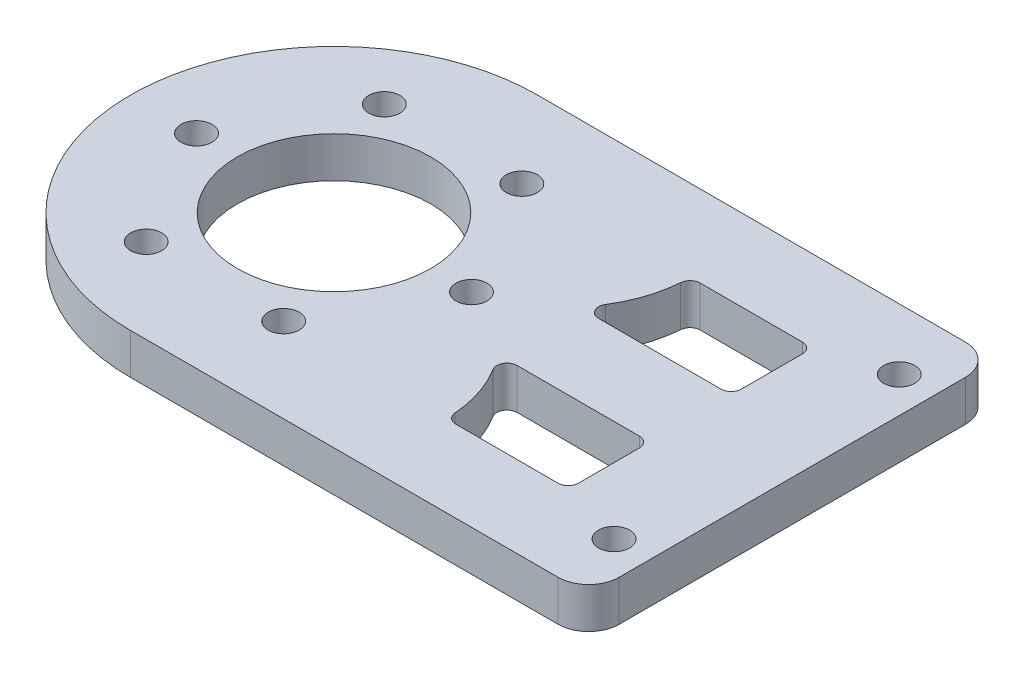
ISO-10303-21;
HEADER;
FILE_DESCRIPTION(('STEP AP214'),'2;1');
FILE_NAME('part.step','',(''),(''),'','','');
FILE_SCHEMA(('AUTOMOTIVE_DESIGN { 1 0 10303 214 1 1 1 1 }'));
ENDSEC;
DATA;
#1=APPLICATION_CONTEXT('core data for automotive mechanical design processes');
#2=APPLICATION_PROTOCOL_DEFINITION('international standard','automotive_design',2000,#1);
#3=PRODUCT_CONTEXT('',#1,'mechanical');
#4=PRODUCT('Part','Part','',(#3));
#5=PRODUCT_RELATED_PRODUCT_CATEGORY('part','',(#4));
#6=PRODUCT_DEFINITION_FORMATION('','',#4);
#7=PRODUCT_DEFINITION_CONTEXT('part definition',#1,'design');
#8=PRODUCT_DEFINITION('design','',#6,#7);
#9=PRODUCT_DEFINITION_SHAPE('','',#8);
#10=(LENGTH_UNIT() NAMED_UNIT(*) SI_UNIT(.MILLI.,.METRE.));
#11=(NAMED_UNIT(*) PLANE_ANGLE_UNIT() SI_UNIT($,.RADIAN.));
#12=(NAMED_UNIT(*) SI_UNIT($,.STERADIAN.) SOLID_ANGLE_UNIT());
#13=UNCERTAINTY_MEASURE_WITH_UNIT(LENGTH_MEASURE(1.E-05),#10,'distance_accuracy_value','');
#14=(GEOMETRIC_REPRESENTATION_CONTEXT(3) GLOBAL_UNCERTAINTY_ASSIGNED_CONTEXT((#13)) GLOBAL_UNIT_ASSIGNED_CONTEXT((#10,
#11,#12)) REPRESENTATION_CONTEXT('',''));
#15=CARTESIAN_POINT('',(0.,0.,0.));
#16=DIRECTION('',(0.,0.,1.));
#17=DIRECTION('',(1.,0.,0.));
#18=AXIS2_PLACEMENT_3D('',#15,#16,#17);
#19=CARTESIAN_POINT('',(-22.5,4.,0.));
#20=DIRECTION('',(0.,-1.,0.));
#21=DIRECTION('',(0.,0.,-1.));
#22=AXIS2_PLACEMENT_3D('',#19,#20,#21);
#23=CYLINDRICAL_SURFACE('',#22,20.);
#24=CARTESIAN_POINT('',(-22.5,0.,0.));
#25=DIRECTION('',(0.,1.,0.));
#26=DIRECTION('',(0.,0.,1.));
#27=AXIS2_PLACEMENT_3D('',#24,#25,#26);
#28=CIRCLE('',#27,20.);
#29=CARTESIAN_POINT('',(-22.5,0.,-20.));
#30=VERTEX_POINT('',#29);
#31=CARTESIAN_POINT('',(-22.5,0.,20.));
#32=VERTEX_POINT('',#31);
#33=EDGE_CURVE('E214',#30,#32,#28,.T.);
#34=ORIENTED_EDGE('',*,*,#33,.T.);
#35=DIRECTION('',(0.,-1.,0.));
#36=VECTOR('',#35,1.);
#37=CARTESIAN_POINT('',(-22.5,4.,20.));
#38=LINE('',#37,#36);
#39=CARTESIAN_POINT('',(-22.5,4.,20.));
#40=VERTEX_POINT('',#39);
#41=EDGE_CURVE('E195',#40,#32,#38,.T.);
#42=ORIENTED_EDGE('',*,*,#41,.F.);
#43=CARTESIAN_POINT('',(-22.5,4.,0.));
#44=DIRECTION('',(0.,1.,0.));
#45=DIRECTION('',(0.,0.,1.));
#46=AXIS2_PLACEMENT_3D('',#43,#44,#45);
#47=CIRCLE('',#46,20.);
#48=CARTESIAN_POINT('',(-22.5,4.,-20.));
#49=VERTEX_POINT('',#48);
#50=EDGE_CURVE('E202',#49,#40,#47,.T.);
#51=ORIENTED_EDGE('',*,*,#50,.F.);
#52=DIRECTION('',(0.,-1.,0.));
#53=VECTOR('',#52,1.);
#54=CARTESIAN_POINT('',(-22.5,4.,-20.));
#55=LINE('',#54,#53);
#56=EDGE_CURVE('E216',#49,#30,#55,.T.);
#57=ORIENTED_EDGE('',*,*,#56,.T.);
#58=EDGE_LOOP('',(#34,#42,#51,#57));
#59=FACE_BOUND('',#58,.T.);
#60=ADVANCED_FACE('F41',(#59),#23,.T.);
#61=CARTESIAN_POINT('',(0.,4.,20.));
#62=DIRECTION('',(0.,0.,-1.));
#63=DIRECTION('',(-1.,0.,0.));
#64=AXIS2_PLACEMENT_3D('',#61,#62,#63);
#65=PLANE('',#64);
#66=DIRECTION('',(1.,0.,0.));
#67=VECTOR('',#66,1.);
#68=CARTESIAN_POINT('',(0.,0.,20.));
#69=LINE('',#68,#67);
#70=CARTESIAN_POINT('',(19.5,0.,20.));
#71=VERTEX_POINT('',#70);
#72=EDGE_CURVE('E397',#32,#71,#69,.T.);
#73=ORIENTED_EDGE('',*,*,#72,.T.);
#74=DIRECTION('',(0.,-1.,0.));
#75=VECTOR('',#74,1.);
#76=CARTESIAN_POINT('',(19.5,4.,20.));
#77=LINE('',#76,#75);
#78=CARTESIAN_POINT('',(19.5,4.,20.));
#79=VERTEX_POINT('',#78);
#80=EDGE_CURVE('E198',#71,#79,#77,.F.);
#81=ORIENTED_EDGE('',*,*,#80,.T.);
#82=DIRECTION('',(1.,0.,0.));
#83=VECTOR('',#82,1.);
#84=CARTESIAN_POINT('',(0.,4.,20.));
#85=LINE('',#84,#83);
#86=EDGE_CURVE('E190',#40,#79,#85,.T.);
#87=ORIENTED_EDGE('',*,*,#86,.F.);
#88=ORIENTED_EDGE('',*,*,#41,.T.);
#89=EDGE_LOOP('',(#73,#81,#87,#88));
#90=FACE_BOUND('',#89,.T.);
#91=ADVANCED_FACE('F193',(#90),#65,.F.);
#92=CARTESIAN_POINT('',(22.5,4.,0.));
#93=DIRECTION('',(-1.,0.,0.));
#94=DIRECTION('',(0.,0.,1.));
#95=AXIS2_PLACEMENT_3D('',#92,#93,#94);
#96=PLANE('',#95);
#97=DIRECTION('',(0.,0.,-1.));
#98=VECTOR('',#97,1.);
#99=CARTESIAN_POINT('',(22.5,0.,0.));
#100=LINE('',#99,#98);
#101=CARTESIAN_POINT('',(22.5,0.,17.));
#102=VERTEX_POINT('',#101);
#103=CARTESIAN_POINT('',(22.5,0.,-17.));
#104=VERTEX_POINT('',#103);
#105=EDGE_CURVE('E399',#102,#104,#100,.T.);
#106=ORIENTED_EDGE('',*,*,#105,.T.);
#107=DIRECTION('',(0.,-1.,0.));
#108=VECTOR('',#107,1.);
#109=CARTESIAN_POINT('',(22.5,4.,-17.));
#110=LINE('',#109,#108);
#111=CARTESIAN_POINT('',(22.5,4.,-17.));
#112=VERTEX_POINT('',#111);
#113=EDGE_CURVE('E230',#104,#112,#110,.F.);
#114=ORIENTED_EDGE('',*,*,#113,.T.);
#115=DIRECTION('',(0.,0.,-1.));
#116=VECTOR('',#115,1.);
#117=CARTESIAN_POINT('',(22.5,4.,0.));
#118=LINE('',#117,#116);
#119=CARTESIAN_POINT('',(22.5,4.,17.));
#120=VERTEX_POINT('',#119);
#121=EDGE_CURVE('E201',#120,#112,#118,.T.);
#122=ORIENTED_EDGE('',*,*,#121,.F.);
#123=DIRECTION('',(0.,-1.,0.));
#124=VECTOR('',#123,1.);
#125=CARTESIAN_POINT('',(22.5,4.,17.));
#126=LINE('',#125,#124);
#127=EDGE_CURVE('E227',#120,#102,#126,.T.);
#128=ORIENTED_EDGE('',*,*,#127,.T.);
#129=EDGE_LOOP('',(#106,#114,#122,#128));
#130=FACE_BOUND('',#129,.T.);
#131=ADVANCED_FACE('F414',(#130),#96,.F.);
#132=CARTESIAN_POINT('',(0.,4.,-20.));
#133=DIRECTION('',(0.,0.,-1.));
#134=DIRECTION('',(-1.,0.,0.));
#135=AXIS2_PLACEMENT_3D('',#132,#133,#134);
#136=PLANE('',#135);
#137=DIRECTION('',(1.,0.,0.));
#138=VECTOR('',#137,1.);
#139=CARTESIAN_POINT('',(0.,4.,-20.));
#140=LINE('',#139,#138);
#141=CARTESIAN_POINT('',(19.5,4.,-20.));
#142=VERTEX_POINT('',#141);
#143=EDGE_CURVE('E209',#49,#142,#140,.T.);
#144=ORIENTED_EDGE('',*,*,#143,.T.);
#145=DIRECTION('',(0.,-1.,0.));
#146=VECTOR('',#145,1.);
#147=CARTESIAN_POINT('',(19.5,0.,-20.));
#148=LINE('',#147,#146);
#149=CARTESIAN_POINT('',(19.5,0.,-20.));
#150=VERTEX_POINT('',#149);
#151=EDGE_CURVE('E215',#142,#150,#148,.T.);
#152=ORIENTED_EDGE('',*,*,#151,.T.);
#153=DIRECTION('',(1.,0.,0.));
#154=VECTOR('',#153,1.);
#155=CARTESIAN_POINT('',(0.,0.,-20.));
#156=LINE('',#155,#154);
#157=EDGE_CURVE('E211',#30,#150,#156,.T.);
#158=ORIENTED_EDGE('',*,*,#157,.F.);
#159=ORIENTED_EDGE('',*,*,#56,.F.);
#160=EDGE_LOOP('',(#144,#152,#158,#159));
#161=FACE_BOUND('',#160,.T.);
#162=ADVANCED_FACE('F406',(#161),#136,.T.);
#163=CARTESIAN_POINT('',(0.,4.,0.));
#164=DIRECTION('',(0.,1.,0.));
#165=DIRECTION('',(0.,0.,1.));
#166=AXIS2_PLACEMENT_3D('',#163,#164,#165);
#167=PLANE('',#166);
#168=CARTESIAN_POINT('',(-11.6666666666667,4.,12.));
#169=DIRECTION('',(0.,1.,0.));
#170=DIRECTION('',(0.,0.,1.));
#171=AXIS2_PLACEMENT_3D('',#168,#169,#170);
#172=CIRCLE('',#171,12.1666666666667);
#173=CARTESIAN_POINT('',(-1.36190229571842,4.,5.53164556962025));
#174=VERTEX_POINT('',#173);
#175=CARTESIAN_POINT('',(0.464858719928123,4.,11.0759493670886));
#176=VERTEX_POINT('',#175);
#177=EDGE_CURVE('E330',#174,#176,#172,.F.);
#178=ORIENTED_EDGE('',*,*,#177,.F.);
#179=CARTESIAN_POINT('',(-0.514935361119928,4.,5.));
#180=DIRECTION('',(0.,1.,0.));
#181=DIRECTION('',(0.,0.,1.));
#182=AXIS2_PLACEMENT_3D('',#179,#180,#181);
#183=CIRCLE('',#182,1.);
#184=CARTESIAN_POINT('',(-0.514935361119928,4.,4.));
#185=VERTEX_POINT('',#184);
#186=EDGE_CURVE('E11',#174,#185,#183,.F.);
#187=ORIENTED_EDGE('',*,*,#186,.T.);
#188=DIRECTION('',(-1.,0.,0.));
#189=VECTOR('',#188,1.);
#190=CARTESIAN_POINT('',(0.,4.,4.));
#191=LINE('',#190,#189);
#192=CARTESIAN_POINT('',(11.5,4.,4.));
#193=VERTEX_POINT('',#192);
#194=EDGE_CURVE('E328',#193,#185,#191,.T.);
#195=ORIENTED_EDGE('',*,*,#194,.F.);
#196=CARTESIAN_POINT('',(11.5,4.,5.));
#197=DIRECTION('',(0.,1.,0.));
#198=DIRECTION('',(0.,0.,1.));
#199=AXIS2_PLACEMENT_3D('',#196,#197,#198);
#200=CIRCLE('',#199,1.);
#201=CARTESIAN_POINT('',(12.5,4.,5.));
#202=VERTEX_POINT('',#201);
#203=EDGE_CURVE('E309',#193,#202,#200,.F.);
#204=ORIENTED_EDGE('',*,*,#203,.T.);
#205=DIRECTION('',(0.,0.,-1.));
#206=VECTOR('',#205,1.);
#207=CARTESIAN_POINT('',(12.5,4.,0.));
#208=LINE('',#207,#206);
#209=CARTESIAN_POINT('',(12.5,4.,11.));
#210=VERTEX_POINT('',#209);
#211=EDGE_CURVE('E334',#210,#202,#208,.T.);
#212=ORIENTED_EDGE('',*,*,#211,.F.);
#213=CARTESIAN_POINT('',(11.5,4.,11.));
#214=DIRECTION('',(0.,1.,0.));
#215=DIRECTION('',(0.,0.,1.));
#216=AXIS2_PLACEMENT_3D('',#213,#214,#215);
#217=CIRCLE('',#216,1.);
#218=CARTESIAN_POINT('',(11.5,4.,12.));
#219=VERTEX_POINT('',#218);
#220=EDGE_CURVE('E306',#210,#219,#217,.F.);
#221=ORIENTED_EDGE('',*,*,#220,.T.);
#222=DIRECTION('',(1.,0.,0.));
#223=VECTOR('',#222,1.);
#224=CARTESIAN_POINT('',(0.,4.,12.));
#225=LINE('',#224,#223);
#226=CARTESIAN_POINT('',(1.46197039553865,4.,12.));
#227=VERTEX_POINT('',#226);
#228=EDGE_CURVE('E338',#227,#219,#225,.T.);
#229=ORIENTED_EDGE('',*,*,#228,.F.);
#230=CARTESIAN_POINT('',(1.46197039553865,4.,11.));
#231=DIRECTION('',(0.,1.,0.));
#232=DIRECTION('',(0.,0.,1.));
#233=AXIS2_PLACEMENT_3D('',#230,#231,#232);
#234=CIRCLE('',#233,1.);
#235=EDGE_CURVE('E302',#227,#176,#234,.F.);
#236=ORIENTED_EDGE('',*,*,#235,.T.);
#237=EDGE_LOOP('',(#178,#187,#195,#204,#212,#221,#229,#236));
#238=FACE_BOUND('',#237,.T.);
#239=CARTESIAN_POINT('',(-11.6666666666667,4.,-12.));
#240=DIRECTION('',(0.,1.,0.));
#241=DIRECTION('',(0.,0.,1.));
#242=AXIS2_PLACEMENT_3D('',#239,#240,#241);
#243=CIRCLE('',#242,12.1666666666667);
#244=CARTESIAN_POINT('',(0.464858719928123,4.,-11.0759493670886));
#245=VERTEX_POINT('',#244);
#246=CARTESIAN_POINT('',(-1.36190229571842,4.,-5.53164556962025));
#247=VERTEX_POINT('',#246);
#248=EDGE_CURVE('E335',#245,#247,#243,.F.);
#249=ORIENTED_EDGE('',*,*,#248,.F.);
#250=CARTESIAN_POINT('',(1.46197039553865,4.,-11.));
#251=DIRECTION('',(0.,1.,0.));
#252=DIRECTION('',(0.,0.,1.));
#253=AXIS2_PLACEMENT_3D('',#250,#251,#252);
#254=CIRCLE('',#253,1.);
#255=CARTESIAN_POINT('',(1.46197039553865,4.,-12.));
#256=VERTEX_POINT('',#255);
#257=EDGE_CURVE('E298',#245,#256,#254,.F.);
#258=ORIENTED_EDGE('',*,*,#257,.T.);
#259=DIRECTION('',(-1.,0.,0.));
#260=VECTOR('',#259,1.);
#261=CARTESIAN_POINT('',(0.,4.,-12.));
#262=LINE('',#261,#260);
#263=CARTESIAN_POINT('',(11.5,4.,-12.));
#264=VERTEX_POINT('',#263);
#265=EDGE_CURVE('E512',#264,#256,#262,.T.);
#266=ORIENTED_EDGE('',*,*,#265,.F.);
#267=CARTESIAN_POINT('',(11.5,4.,-11.));
#268=DIRECTION('',(0.,1.,0.));
#269=DIRECTION('',(0.,0.,1.));
#270=AXIS2_PLACEMENT_3D('',#267,#268,#269);
#271=CIRCLE('',#270,1.);
#272=CARTESIAN_POINT('',(12.5,4.,-11.));
#273=VERTEX_POINT('',#272);
#274=EDGE_CURVE('E294',#264,#273,#271,.F.);
#275=ORIENTED_EDGE('',*,*,#274,.T.);
#276=DIRECTION('',(0.,0.,-1.));
#277=VECTOR('',#276,1.);
#278=CARTESIAN_POINT('',(12.5,4.,0.));
#279=LINE('',#278,#277);
#280=CARTESIAN_POINT('',(12.5,4.,-5.00000000000001));
#281=VERTEX_POINT('',#280);
#282=EDGE_CURVE('E541',#281,#273,#279,.T.);
#283=ORIENTED_EDGE('',*,*,#282,.F.);
#284=CARTESIAN_POINT('',(11.5,4.,-5.00000000000001));
#285=DIRECTION('',(0.,1.,0.));
#286=DIRECTION('',(0.,0.,1.));
#287=AXIS2_PLACEMENT_3D('',#284,#285,#286);
#288=CIRCLE('',#287,1.);
#289=CARTESIAN_POINT('',(11.5,4.,-4.00000000000001));
#290=VERTEX_POINT('',#289);
#291=EDGE_CURVE('E290',#281,#290,#288,.F.);
#292=ORIENTED_EDGE('',*,*,#291,.T.);
#293=DIRECTION('',(1.,0.,0.));
#294=VECTOR('',#293,1.);
#295=CARTESIAN_POINT('',(0.,4.,-4.));
#296=LINE('',#295,#294);
#297=CARTESIAN_POINT('',(-0.514935361119928,4.,-4.));
#298=VERTEX_POINT('',#297);
#299=EDGE_CURVE('E341',#298,#290,#296,.T.);
#300=ORIENTED_EDGE('',*,*,#299,.F.);
#301=CARTESIAN_POINT('',(-0.514935361119928,4.,-5.));
#302=DIRECTION('',(0.,1.,0.));
#303=DIRECTION('',(0.,0.,1.));
#304=AXIS2_PLACEMENT_3D('',#301,#302,#303);
#305=CIRCLE('',#304,1.);
#306=EDGE_CURVE('E286',#298,#247,#305,.F.);
#307=ORIENTED_EDGE('',*,*,#306,.T.);
#308=EDGE_LOOP('',(#249,#258,#266,#275,#283,#292,#300,#307));
#309=FACE_BOUND('',#308,.T.);
#310=CARTESIAN_POINT('',(19.0000000000001,4.,13.9999999999024));
#311=DIRECTION('',(0.,1.,0.));
#312=DIRECTION('',(0.,0.,1.));
#313=AXIS2_PLACEMENT_3D('',#310,#311,#312);
#314=CIRCLE('',#313,1.525);
#315=CARTESIAN_POINT('',(19.0000000000001,4.,15.5249999999024));
#316=VERTEX_POINT('',#315);
#317=EDGE_CURVE('E242',#316,#316,#314,.T.);
#318=ORIENTED_EDGE('',*,*,#317,.F.);
#319=EDGE_LOOP('',(#318));
#320=FACE_BOUND('',#319,.T.);
#321=CARTESIAN_POINT('',(18.9999999984967,4.,-13.9999999984623));
#322=DIRECTION('',(0.,1.,0.));
#323=DIRECTION('',(0.,0.,1.));
#324=AXIS2_PLACEMENT_3D('',#321,#322,#323);
#325=CIRCLE('',#324,1.525);
#326=CARTESIAN_POINT('',(18.9999999984967,4.,-12.4749999984623));
#327=VERTEX_POINT('',#326);
#328=EDGE_CURVE('E348',#327,#327,#325,.T.);
#329=ORIENTED_EDGE('',*,*,#328,.F.);
#330=EDGE_LOOP('',(#329));
#331=FACE_BOUND('',#330,.T.);
#332=CARTESIAN_POINT('',(-22.5,4.,0.));
#333=DIRECTION('',(0.,-1.,0.));
#334=DIRECTION('',(0.,0.,-1.));
#335=AXIS2_PLACEMENT_3D('',#332,#333,#334);
#336=CIRCLE('',#335,9.5);
#337=CARTESIAN_POINT('',(-22.5,4.,-9.5));
#338=VERTEX_POINT('',#337);
#339=EDGE_CURVE('E353',#338,#338,#336,.T.);
#340=ORIENTED_EDGE('',*,*,#339,.T.);
#341=EDGE_LOOP('',(#340));
#342=FACE_BOUND('',#341,.T.);
#343=CARTESIAN_POINT('',(-36.,4.,0.));
#344=DIRECTION('',(0.,1.,0.));
#345=DIRECTION('',(0.,0.,1.));
#346=AXIS2_PLACEMENT_3D('',#343,#344,#345);
#347=CIRCLE('',#346,1.525);
#348=CARTESIAN_POINT('',(-36.,4.,1.525));
#349=VERTEX_POINT('',#348);
#350=EDGE_CURVE('E359',#349,#349,#347,.T.);
#351=ORIENTED_EDGE('',*,*,#350,.F.);
#352=EDGE_LOOP('',(#351));
#353=FACE_BOUND('',#352,.T.);
#354=CARTESIAN_POINT('',(-29.25,4.,11.6913429510899));
#355=DIRECTION('',(0.,1.,0.));
#356=DIRECTION('',(0.,0.,1.));
#357=AXIS2_PLACEMENT_3D('',#354,#355,#356);
#358=CIRCLE('',#357,1.525);
#359=CARTESIAN_POINT('',(-29.25,4.,13.2163429510899));
#360=VERTEX_POINT('',#359);
#361=EDGE_CURVE('E366',#360,#360,#358,.T.);
#362=ORIENTED_EDGE('',*,*,#361,.F.);
#363=EDGE_LOOP('',(#362));
#364=FACE_BOUND('',#363,.T.);
#365=CARTESIAN_POINT('',(-15.75,4.,11.6913429510899));
#366=DIRECTION('',(0.,1.,0.));
#367=DIRECTION('',(0.,0.,1.));
#368=AXIS2_PLACEMENT_3D('',#365,#366,#367);
#369=CIRCLE('',#368,1.525);
#370=CARTESIAN_POINT('',(-15.75,4.,13.2163429510899));
#371=VERTEX_POINT('',#370);
#372=EDGE_CURVE('E389',#371,#371,#369,.T.);
#373=ORIENTED_EDGE('',*,*,#372,.F.);
#374=EDGE_LOOP('',(#373));
#375=FACE_BOUND('',#374,.T.);
#376=CARTESIAN_POINT('',(-8.99999999999999,4.,0.));
#377=DIRECTION('',(0.,1.,0.));
#378=DIRECTION('',(0.,0.,1.));
#379=AXIS2_PLACEMENT_3D('',#376,#377,#378);
#380=CIRCLE('',#379,1.525);
#381=CARTESIAN_POINT('',(-8.99999999999999,4.,1.525));
#382=VERTEX_POINT('',#381);
#383=EDGE_CURVE('E383',#382,#382,#380,.T.);
#384=ORIENTED_EDGE('',*,*,#383,.F.);
#385=EDGE_LOOP('',(#384));
#386=FACE_BOUND('',#385,.T.);
#387=CARTESIAN_POINT('',(-15.75,4.,-11.6913429510899));
#388=DIRECTION('',(0.,1.,0.));
#389=DIRECTION('',(0.,0.,1.));
#390=AXIS2_PLACEMENT_3D('',#387,#388,#389);
#391=CIRCLE('',#390,1.525);
#392=CARTESIAN_POINT('',(-15.75,4.,-10.1663429510899));
#393=VERTEX_POINT('',#392);
#394=EDGE_CURVE('E377',#393,#393,#391,.T.);
#395=ORIENTED_EDGE('',*,*,#394,.F.);
#396=EDGE_LOOP('',(#395));
#397=FACE_BOUND('',#396,.T.);
#398=CARTESIAN_POINT('',(-29.25,4.,-11.6913429510899));
#399=DIRECTION('',(0.,1.,0.));
#400=DIRECTION('',(0.,0.,1.));
#401=AXIS2_PLACEMENT_3D('',#398,#399,#400);
#402=CIRCLE('',#401,1.525);
#403=CARTESIAN_POINT('',(-29.25,4.,-10.1663429510899));
#404=VERTEX_POINT('',#403);
#405=EDGE_CURVE('E365',#404,#404,#402,.T.);
#406=ORIENTED_EDGE('',*,*,#405,.F.);
#407=EDGE_LOOP('',(#406));
#408=FACE_BOUND('',#407,.T.);
#409=ORIENTED_EDGE('',*,*,#121,.T.);
#410=CARTESIAN_POINT('',(19.5,4.,-17.));
#411=DIRECTION('',(0.,1.,0.));
#412=DIRECTION('',(0.,0.,1.));
#413=AXIS2_PLACEMENT_3D('',#410,#411,#412);
#414=CIRCLE('',#413,3.);
#415=EDGE_CURVE('E234',#112,#142,#414,.T.);
#416=ORIENTED_EDGE('',*,*,#415,.T.);
#417=ORIENTED_EDGE('',*,*,#143,.F.);
#418=ORIENTED_EDGE('',*,*,#50,.T.);
#419=ORIENTED_EDGE('',*,*,#86,.T.);
#420=CARTESIAN_POINT('',(19.5,4.,17.));
#421=DIRECTION('',(0.,1.,0.));
#422=DIRECTION('',(0.,0.,1.));
#423=AXIS2_PLACEMENT_3D('',#420,#421,#422);
#424=CIRCLE('',#423,3.);
#425=EDGE_CURVE('E232',#79,#120,#424,.T.);
#426=ORIENTED_EDGE('',*,*,#425,.T.);
#427=EDGE_LOOP('',(#409,#416,#417,#418,#419,#426));
#428=FACE_BOUND('',#427,.T.);
#429=ADVANCED_FACE('F207',(#238,#309,#320,#331,#342,#353,#364,#375,#386,#397,#408,#428),#167,.T.);
#430=CARTESIAN_POINT('',(0.,0.,0.));
#431=DIRECTION('',(0.,1.,0.));
#432=DIRECTION('',(0.,0.,1.));
#433=AXIS2_PLACEMENT_3D('',#430,#431,#432);
#434=PLANE('',#433);
#435=DIRECTION('',(1.,0.,0.));
#436=VECTOR('',#435,1.);
#437=CARTESIAN_POINT('',(-2.5,0.,4.));
#438=LINE('',#437,#436);
#439=CARTESIAN_POINT('',(-0.514935361119928,0.,4.));
#440=VERTEX_POINT('',#439);
#441=CARTESIAN_POINT('',(11.5,0.,4.));
#442=VERTEX_POINT('',#441);
#443=EDGE_CURVE('E315',#440,#442,#438,.T.);
#444=ORIENTED_EDGE('',*,*,#443,.F.);
#445=CARTESIAN_POINT('',(-0.514935361119928,0.,5.));
#446=DIRECTION('',(0.,1.,0.));
#447=DIRECTION('',(0.,0.,1.));
#448=AXIS2_PLACEMENT_3D('',#445,#446,#447);
#449=CIRCLE('',#448,1.);
#450=CARTESIAN_POINT('',(-1.36190229571842,0.,5.53164556962025));
#451=VERTEX_POINT('',#450);
#452=EDGE_CURVE('E49',#440,#451,#449,.T.);
#453=ORIENTED_EDGE('',*,*,#452,.T.);
#454=CARTESIAN_POINT('',(-11.6666666666667,0.,12.));
#455=DIRECTION('',(0.,1.,0.));
#456=DIRECTION('',(0.,0.,1.));
#457=AXIS2_PLACEMENT_3D('',#454,#455,#456);
#458=CIRCLE('',#457,12.1666666666667);
#459=CARTESIAN_POINT('',(0.464858719928123,0.,11.0759493670886));
#460=VERTEX_POINT('',#459);
#461=EDGE_CURVE('E314',#460,#451,#458,.T.);
#462=ORIENTED_EDGE('',*,*,#461,.F.);
#463=CARTESIAN_POINT('',(1.46197039553865,0.,11.));
#464=DIRECTION('',(0.,1.,0.));
#465=DIRECTION('',(0.,0.,1.));
#466=AXIS2_PLACEMENT_3D('',#463,#464,#465);
#467=CIRCLE('',#466,1.);
#468=CARTESIAN_POINT('',(1.46197039553865,0.,12.));
#469=VERTEX_POINT('',#468);
#470=EDGE_CURVE('E300',#460,#469,#467,.T.);
#471=ORIENTED_EDGE('',*,*,#470,.T.);
#472=DIRECTION('',(-1.,0.,0.));
#473=VECTOR('',#472,1.);
#474=CARTESIAN_POINT('',(12.5,0.,12.));
#475=LINE('',#474,#473);
#476=CARTESIAN_POINT('',(11.5,0.,12.));
#477=VERTEX_POINT('',#476);
#478=EDGE_CURVE('E508',#477,#469,#475,.T.);
#479=ORIENTED_EDGE('',*,*,#478,.F.);
#480=CARTESIAN_POINT('',(11.5,0.,11.));
#481=DIRECTION('',(0.,1.,0.));
#482=DIRECTION('',(0.,0.,1.));
#483=AXIS2_PLACEMENT_3D('',#480,#481,#482);
#484=CIRCLE('',#483,1.);
#485=CARTESIAN_POINT('',(12.5,0.,11.));
#486=VERTEX_POINT('',#485);
#487=EDGE_CURVE('E304',#477,#486,#484,.T.);
#488=ORIENTED_EDGE('',*,*,#487,.T.);
#489=DIRECTION('',(0.,0.,1.));
#490=VECTOR('',#489,1.);
#491=CARTESIAN_POINT('',(12.5,0.,4.));
#492=LINE('',#491,#490);
#493=CARTESIAN_POINT('',(12.5,0.,5.));
#494=VERTEX_POINT('',#493);
#495=EDGE_CURVE('E513',#494,#486,#492,.T.);
#496=ORIENTED_EDGE('',*,*,#495,.F.);
#497=CARTESIAN_POINT('',(11.5,0.,5.));
#498=DIRECTION('',(0.,1.,0.));
#499=DIRECTION('',(0.,0.,1.));
#500=AXIS2_PLACEMENT_3D('',#497,#498,#499);
#501=CIRCLE('',#500,1.);
#502=EDGE_CURVE('E56',#494,#442,#501,.T.);
#503=ORIENTED_EDGE('',*,*,#502,.T.);
#504=EDGE_LOOP('',(#444,#453,#462,#471,#479,#488,#496,#503));
#505=FACE_BOUND('',#504,.T.);
#506=DIRECTION('',(1.,0.,0.));
#507=VECTOR('',#506,1.);
#508=CARTESIAN_POINT('',(12.5,0.,-12.));
#509=LINE('',#508,#507);
#510=CARTESIAN_POINT('',(1.46197039553865,0.,-12.));
#511=VERTEX_POINT('',#510);
#512=CARTESIAN_POINT('',(11.5,0.,-12.));
#513=VERTEX_POINT('',#512);
#514=EDGE_CURVE('E531',#511,#513,#509,.T.);
#515=ORIENTED_EDGE('',*,*,#514,.F.);
#516=CARTESIAN_POINT('',(1.46197039553865,0.,-11.));
#517=DIRECTION('',(0.,1.,0.));
#518=DIRECTION('',(0.,0.,1.));
#519=AXIS2_PLACEMENT_3D('',#516,#517,#518);
#520=CIRCLE('',#519,1.);
#521=CARTESIAN_POINT('',(0.464858719928123,0.,-11.0759493670886));
#522=VERTEX_POINT('',#521);
#523=EDGE_CURVE('E296',#511,#522,#520,.T.);
#524=ORIENTED_EDGE('',*,*,#523,.T.);
#525=CARTESIAN_POINT('',(-11.6666666666667,0.,-12.));
#526=DIRECTION('',(0.,1.,0.));
#527=DIRECTION('',(0.,0.,-1.));
#528=AXIS2_PLACEMENT_3D('',#525,#526,#527);
#529=CIRCLE('',#528,12.1666666666667);
#530=CARTESIAN_POINT('',(-1.36190229571842,0.,-5.53164556962025));
#531=VERTEX_POINT('',#530);
#532=EDGE_CURVE('E528',#531,#522,#529,.T.);
#533=ORIENTED_EDGE('',*,*,#532,.F.);
#534=CARTESIAN_POINT('',(-0.514935361119928,0.,-5.));
#535=DIRECTION('',(0.,1.,0.));
#536=DIRECTION('',(0.,0.,1.));
#537=AXIS2_PLACEMENT_3D('',#534,#535,#536);
#538=CIRCLE('',#537,1.);
#539=CARTESIAN_POINT('',(-0.514935361119928,0.,-4.));
#540=VERTEX_POINT('',#539);
#541=EDGE_CURVE('E284',#531,#540,#538,.T.);
#542=ORIENTED_EDGE('',*,*,#541,.T.);
#543=DIRECTION('',(-1.,0.,0.));
#544=VECTOR('',#543,1.);
#545=CARTESIAN_POINT('',(-2.5,0.,-4.));
#546=LINE('',#545,#544);
#547=CARTESIAN_POINT('',(11.5,0.,-4.00000000000001));
#548=VERTEX_POINT('',#547);
#549=EDGE_CURVE('E321',#548,#540,#546,.T.);
#550=ORIENTED_EDGE('',*,*,#549,.F.);
#551=CARTESIAN_POINT('',(11.5,0.,-5.00000000000001));
#552=DIRECTION('',(0.,1.,0.));
#553=DIRECTION('',(0.,0.,1.));
#554=AXIS2_PLACEMENT_3D('',#551,#552,#553);
#555=CIRCLE('',#554,1.);
#556=CARTESIAN_POINT('',(12.5,0.,-5.00000000000001));
#557=VERTEX_POINT('',#556);
#558=EDGE_CURVE('E288',#548,#557,#555,.T.);
#559=ORIENTED_EDGE('',*,*,#558,.T.);
#560=DIRECTION('',(0.,0.,1.));
#561=VECTOR('',#560,1.);
#562=CARTESIAN_POINT('',(12.5,0.,-4.00000000000001));
#563=LINE('',#562,#561);
#564=CARTESIAN_POINT('',(12.5,0.,-11.));
#565=VERTEX_POINT('',#564);
#566=EDGE_CURVE('E534',#565,#557,#563,.T.);
#567=ORIENTED_EDGE('',*,*,#566,.F.);
#568=CARTESIAN_POINT('',(11.5,0.,-11.));
#569=DIRECTION('',(0.,1.,0.));
#570=DIRECTION('',(0.,0.,1.));
#571=AXIS2_PLACEMENT_3D('',#568,#569,#570);
#572=CIRCLE('',#571,1.);
#573=EDGE_CURVE('E292',#565,#513,#572,.T.);
#574=ORIENTED_EDGE('',*,*,#573,.T.);
#575=EDGE_LOOP('',(#515,#524,#533,#542,#550,#559,#567,#574));
#576=FACE_BOUND('',#575,.T.);
#577=CARTESIAN_POINT('',(19.0000000000001,0.,13.9999999999024));
#578=DIRECTION('',(0.,1.,0.));
#579=DIRECTION('',(0.,0.,1.));
#580=AXIS2_PLACEMENT_3D('',#577,#578,#579);
#581=CIRCLE('',#580,1.525);
#582=CARTESIAN_POINT('',(19.0000000000001,0.,15.5249999999024));
#583=VERTEX_POINT('',#582);
#584=EDGE_CURVE('E241',#583,#583,#581,.T.);
#585=ORIENTED_EDGE('',*,*,#584,.T.);
#586=EDGE_LOOP('',(#585));
#587=FACE_BOUND('',#586,.T.);
#588=CARTESIAN_POINT('',(18.9999999984967,0.,-13.9999999984623));
#589=DIRECTION('',(0.,1.,0.));
#590=DIRECTION('',(0.,0.,1.));
#591=AXIS2_PLACEMENT_3D('',#588,#589,#590);
#592=CIRCLE('',#591,1.525);
#593=CARTESIAN_POINT('',(18.9999999984967,0.,-12.4749999984623));
#594=VERTEX_POINT('',#593);
#595=EDGE_CURVE('E238',#594,#594,#592,.T.);
#596=ORIENTED_EDGE('',*,*,#595,.T.);
#597=EDGE_LOOP('',(#596));
#598=FACE_BOUND('',#597,.T.);
#599=CARTESIAN_POINT('',(-22.5,0.,0.));
#600=DIRECTION('',(0.,-1.,0.));
#601=DIRECTION('',(0.,0.,-1.));
#602=AXIS2_PLACEMENT_3D('',#599,#600,#601);
#603=CIRCLE('',#602,9.5);
#604=CARTESIAN_POINT('',(-22.5,0.,-9.5));
#605=VERTEX_POINT('',#604);
#606=EDGE_CURVE('E245',#605,#605,#603,.T.);
#607=ORIENTED_EDGE('',*,*,#606,.F.);
#608=EDGE_LOOP('',(#607));
#609=FACE_BOUND('',#608,.T.);
#610=CARTESIAN_POINT('',(-36.,0.,0.));
#611=DIRECTION('',(0.,1.,0.));
#612=DIRECTION('',(0.,0.,1.));
#613=AXIS2_PLACEMENT_3D('',#610,#611,#612);
#614=CIRCLE('',#613,1.525);
#615=CARTESIAN_POINT('',(-36.,0.,1.525));
#616=VERTEX_POINT('',#615);
#617=EDGE_CURVE('E362',#616,#616,#614,.T.);
#618=ORIENTED_EDGE('',*,*,#617,.T.);
#619=EDGE_LOOP('',(#618));
#620=FACE_BOUND('',#619,.T.);
#621=CARTESIAN_POINT('',(-29.25,0.,11.6913429510899));
#622=DIRECTION('',(0.,1.,0.));
#623=DIRECTION('',(0.,0.,1.));
#624=AXIS2_PLACEMENT_3D('',#621,#622,#623);
#625=CIRCLE('',#624,1.525);
#626=CARTESIAN_POINT('',(-29.25,0.,13.2163429510899));
#627=VERTEX_POINT('',#626);
#628=EDGE_CURVE('E356',#627,#627,#625,.T.);
#629=ORIENTED_EDGE('',*,*,#628,.T.);
#630=EDGE_LOOP('',(#629));
#631=FACE_BOUND('',#630,.T.);
#632=CARTESIAN_POINT('',(-15.75,0.,11.6913429510899));
#633=DIRECTION('',(0.,1.,0.));
#634=DIRECTION('',(0.,0.,1.));
#635=AXIS2_PLACEMENT_3D('',#632,#633,#634);
#636=CIRCLE('',#635,1.525);
#637=CARTESIAN_POINT('',(-15.75,0.,13.2163429510899));
#638=VERTEX_POINT('',#637);
#639=EDGE_CURVE('E369',#638,#638,#636,.T.);
#640=ORIENTED_EDGE('',*,*,#639,.T.);
#641=EDGE_LOOP('',(#640));
#642=FACE_BOUND('',#641,.T.);
#643=CARTESIAN_POINT('',(-8.99999999999999,0.,0.));
#644=DIRECTION('',(0.,1.,0.));
#645=DIRECTION('',(0.,0.,1.));
#646=AXIS2_PLACEMENT_3D('',#643,#644,#645);
#647=CIRCLE('',#646,1.525);
#648=CARTESIAN_POINT('',(-8.99999999999999,0.,1.525));
#649=VERTEX_POINT('',#648);
#650=EDGE_CURVE('E386',#649,#649,#647,.T.);
#651=ORIENTED_EDGE('',*,*,#650,.T.);
#652=EDGE_LOOP('',(#651));
#653=FACE_BOUND('',#652,.T.);
#654=CARTESIAN_POINT('',(-15.75,0.,-11.6913429510899));
#655=DIRECTION('',(0.,1.,0.));
#656=DIRECTION('',(0.,0.,1.));
#657=AXIS2_PLACEMENT_3D('',#654,#655,#656);
#658=CIRCLE('',#657,1.525);
#659=CARTESIAN_POINT('',(-15.75,0.,-10.1663429510899));
#660=VERTEX_POINT('',#659);
#661=EDGE_CURVE('E380',#660,#660,#658,.T.);
#662=ORIENTED_EDGE('',*,*,#661,.T.);
#663=EDGE_LOOP('',(#662));
#664=FACE_BOUND('',#663,.T.);
#665=CARTESIAN_POINT('',(-29.25,0.,-11.6913429510899));
#666=DIRECTION('',(0.,1.,0.));
#667=DIRECTION('',(0.,0.,1.));
#668=AXIS2_PLACEMENT_3D('',#665,#666,#667);
#669=CIRCLE('',#668,1.525);
#670=CARTESIAN_POINT('',(-29.25,0.,-10.1663429510899));
#671=VERTEX_POINT('',#670);
#672=EDGE_CURVE('E374',#671,#671,#669,.T.);
#673=ORIENTED_EDGE('',*,*,#672,.T.);
#674=EDGE_LOOP('',(#673));
#675=FACE_BOUND('',#674,.T.);
#676=ORIENTED_EDGE('',*,*,#157,.T.);
#677=CARTESIAN_POINT('',(19.5,0.,-17.));
#678=DIRECTION('',(0.,1.,0.));
#679=DIRECTION('',(0.,0.,1.));
#680=AXIS2_PLACEMENT_3D('',#677,#678,#679);
#681=CIRCLE('',#680,3.);
#682=EDGE_CURVE('E225',#150,#104,#681,.F.);
#683=ORIENTED_EDGE('',*,*,#682,.T.);
#684=ORIENTED_EDGE('',*,*,#105,.F.);
#685=CARTESIAN_POINT('',(19.5,0.,17.));
#686=DIRECTION('',(0.,1.,0.));
#687=DIRECTION('',(0.,0.,1.));
#688=AXIS2_PLACEMENT_3D('',#685,#686,#687);
#689=CIRCLE('',#688,3.);
#690=EDGE_CURVE('E219',#102,#71,#689,.F.);
#691=ORIENTED_EDGE('',*,*,#690,.T.);
#692=ORIENTED_EDGE('',*,*,#72,.F.);
#693=ORIENTED_EDGE('',*,*,#33,.F.);
#694=EDGE_LOOP('',(#676,#683,#684,#691,#692,#693));
#695=FACE_BOUND('',#694,.T.);
#696=ADVANCED_FACE('F312',(#505,#576,#587,#598,#609,#620,#631,#642,#653,#664,#675,#695),#434,.F.);
#697=CARTESIAN_POINT('',(-29.25,4.,-11.6913429510899));
#698=DIRECTION('',(0.,-1.,0.));
#699=DIRECTION('',(0.,0.,-1.));
#700=AXIS2_PLACEMENT_3D('',#697,#698,#699);
#701=CYLINDRICAL_SURFACE('',#700,1.525);
#702=ORIENTED_EDGE('',*,*,#405,.T.);
#703=EDGE_LOOP('',(#702));
#704=FACE_BOUND('',#703,.T.);
#705=ORIENTED_EDGE('',*,*,#672,.F.);
#706=EDGE_LOOP('',(#705));
#707=FACE_BOUND('',#706,.T.);
#708=ADVANCED_FACE('F444',(#704,#707),#701,.F.);
#709=CARTESIAN_POINT('',(-15.75,4.,-11.6913429510899));
#710=DIRECTION('',(0.,-1.,0.));
#711=DIRECTION('',(0.,0.,-1.));
#712=AXIS2_PLACEMENT_3D('',#709,#710,#711);
#713=CYLINDRICAL_SURFACE('',#712,1.525);
#714=ORIENTED_EDGE('',*,*,#394,.T.);
#715=EDGE_LOOP('',(#714));
#716=FACE_BOUND('',#715,.T.);
#717=ORIENTED_EDGE('',*,*,#661,.F.);
#718=EDGE_LOOP('',(#717));
#719=FACE_BOUND('',#718,.T.);
#720=ADVANCED_FACE('F455',(#716,#719),#713,.F.);
#721=CARTESIAN_POINT('',(-8.99999999999999,4.,0.));
#722=DIRECTION('',(0.,-1.,0.));
#723=DIRECTION('',(0.,0.,-1.));
#724=AXIS2_PLACEMENT_3D('',#721,#722,#723);
#725=CYLINDRICAL_SURFACE('',#724,1.525);
#726=ORIENTED_EDGE('',*,*,#383,.T.);
#727=EDGE_LOOP('',(#726));
#728=FACE_BOUND('',#727,.T.);
#729=ORIENTED_EDGE('',*,*,#650,.F.);
#730=EDGE_LOOP('',(#729));
#731=FACE_BOUND('',#730,.T.);
#732=ADVANCED_FACE('F451',(#728,#731),#725,.F.);
#733=CARTESIAN_POINT('',(-15.75,4.,11.6913429510899));
#734=DIRECTION('',(0.,-1.,0.));
#735=DIRECTION('',(0.,0.,-1.));
#736=AXIS2_PLACEMENT_3D('',#733,#734,#735);
#737=CYLINDRICAL_SURFACE('',#736,1.525);
#738=ORIENTED_EDGE('',*,*,#372,.T.);
#739=EDGE_LOOP('',(#738));
#740=FACE_BOUND('',#739,.T.);
#741=ORIENTED_EDGE('',*,*,#639,.F.);
#742=EDGE_LOOP('',(#741));
#743=FACE_BOUND('',#742,.T.);
#744=ADVANCED_FACE('F447',(#740,#743),#737,.F.);
#745=CARTESIAN_POINT('',(-29.25,4.,11.6913429510899));
#746=DIRECTION('',(0.,-1.,0.));
#747=DIRECTION('',(0.,0.,-1.));
#748=AXIS2_PLACEMENT_3D('',#745,#746,#747);
#749=CYLINDRICAL_SURFACE('',#748,1.525);
#750=ORIENTED_EDGE('',*,*,#361,.T.);
#751=EDGE_LOOP('',(#750));
#752=FACE_BOUND('',#751,.T.);
#753=ORIENTED_EDGE('',*,*,#628,.F.);
#754=EDGE_LOOP('',(#753));
#755=FACE_BOUND('',#754,.T.);
#756=ADVANCED_FACE('F450',(#752,#755),#749,.F.);
#757=CARTESIAN_POINT('',(-36.,4.,0.));
#758=DIRECTION('',(0.,-1.,0.));
#759=DIRECTION('',(0.,0.,-1.));
#760=AXIS2_PLACEMENT_3D('',#757,#758,#759);
#761=CYLINDRICAL_SURFACE('',#760,1.525);
#762=ORIENTED_EDGE('',*,*,#350,.T.);
#763=EDGE_LOOP('',(#762));
#764=FACE_BOUND('',#763,.T.);
#765=ORIENTED_EDGE('',*,*,#617,.F.);
#766=EDGE_LOOP('',(#765));
#767=FACE_BOUND('',#766,.T.);
#768=ADVANCED_FACE('F465',(#764,#767),#761,.F.);
#769=CARTESIAN_POINT('',(-22.5,4.,0.));
#770=DIRECTION('',(0.,-1.,0.));
#771=DIRECTION('',(0.,0.,-1.));
#772=AXIS2_PLACEMENT_3D('',#769,#770,#771);
#773=CYLINDRICAL_SURFACE('',#772,9.5);
#774=ORIENTED_EDGE('',*,*,#339,.F.);
#775=EDGE_LOOP('',(#774));
#776=FACE_BOUND('',#775,.T.);
#777=ORIENTED_EDGE('',*,*,#606,.T.);
#778=EDGE_LOOP('',(#777));
#779=FACE_BOUND('',#778,.T.);
#780=ADVANCED_FACE('F428',(#776,#779),#773,.F.);
#781=CARTESIAN_POINT('',(19.5,4.,-17.));
#782=DIRECTION('',(0.,1.,0.));
#783=DIRECTION('',(0.,0.,1.));
#784=AXIS2_PLACEMENT_3D('',#781,#782,#783);
#785=CYLINDRICAL_SURFACE('',#784,3.);
#786=ORIENTED_EDGE('',*,*,#415,.F.);
#787=ORIENTED_EDGE('',*,*,#113,.F.);
#788=ORIENTED_EDGE('',*,*,#682,.F.);
#789=ORIENTED_EDGE('',*,*,#151,.F.);
#790=EDGE_LOOP('',(#786,#787,#788,#789));
#791=FACE_BOUND('',#790,.T.);
#792=ADVANCED_FACE('F410',(#791),#785,.T.);
#793=CARTESIAN_POINT('',(19.5,4.,17.));
#794=DIRECTION('',(0.,-1.,0.));
#795=DIRECTION('',(0.,0.,-1.));
#796=AXIS2_PLACEMENT_3D('',#793,#794,#795);
#797=CYLINDRICAL_SURFACE('',#796,3.);
#798=ORIENTED_EDGE('',*,*,#425,.F.);
#799=ORIENTED_EDGE('',*,*,#80,.F.);
#800=ORIENTED_EDGE('',*,*,#690,.F.);
#801=ORIENTED_EDGE('',*,*,#127,.F.);
#802=EDGE_LOOP('',(#798,#799,#800,#801));
#803=FACE_BOUND('',#802,.T.);
#804=ADVANCED_FACE('F417',(#803),#797,.T.);
#805=CARTESIAN_POINT('',(18.9999999984967,-6.,-13.9999999984623));
#806=DIRECTION('',(0.,1.,0.));
#807=DIRECTION('',(0.,0.,1.));
#808=AXIS2_PLACEMENT_3D('',#805,#806,#807);
#809=CYLINDRICAL_SURFACE('',#808,1.525);
#810=ORIENTED_EDGE('',*,*,#328,.T.);
#811=EDGE_LOOP('',(#810));
#812=FACE_BOUND('',#811,.T.);
#813=ORIENTED_EDGE('',*,*,#595,.F.);
#814=EDGE_LOOP('',(#813));
#815=FACE_BOUND('',#814,.T.);
#816=ADVANCED_FACE('F419',(#812,#815),#809,.F.);
#817=CARTESIAN_POINT('',(19.0000000000001,-6.,13.9999999999024));
#818=DIRECTION('',(0.,1.,0.));
#819=DIRECTION('',(0.,0.,1.));
#820=AXIS2_PLACEMENT_3D('',#817,#818,#819);
#821=CYLINDRICAL_SURFACE('',#820,1.525);
#822=ORIENTED_EDGE('',*,*,#317,.T.);
#823=EDGE_LOOP('',(#822));
#824=FACE_BOUND('',#823,.T.);
#825=ORIENTED_EDGE('',*,*,#584,.F.);
#826=EDGE_LOOP('',(#825));
#827=FACE_BOUND('',#826,.T.);
#828=ADVANCED_FACE('F425',(#824,#827),#821,.F.);
#829=CARTESIAN_POINT('',(-11.6666666666667,10.,-12.));
#830=DIRECTION('',(0.,-1.,0.));
#831=DIRECTION('',(0.,0.,-1.));
#832=AXIS2_PLACEMENT_3D('',#829,#830,#831);
#833=CYLINDRICAL_SURFACE('',#832,12.1666666666667);
#834=ORIENTED_EDGE('',*,*,#248,.T.);
#835=DIRECTION('',(0.,-1.,0.));
#836=VECTOR('',#835,1.);
#837=CARTESIAN_POINT('',(-1.36190229571842,10.,-5.53164556962025));
#838=LINE('',#837,#836);
#839=EDGE_CURVE('E247',#247,#531,#838,.T.);
#840=ORIENTED_EDGE('',*,*,#839,.T.);
#841=ORIENTED_EDGE('',*,*,#532,.T.);
#842=DIRECTION('',(0.,-1.,0.));
#843=VECTOR('',#842,1.);
#844=CARTESIAN_POINT('',(0.464858719928123,10.,-11.0759493670886));
#845=LINE('',#844,#843);
#846=EDGE_CURVE('E237',#522,#245,#845,.F.);
#847=ORIENTED_EDGE('',*,*,#846,.T.);
#848=EDGE_LOOP('',(#834,#840,#841,#847));
#849=FACE_BOUND('',#848,.T.);
#850=ADVANCED_FACE('F475',(#849),#833,.T.);
#851=CARTESIAN_POINT('',(-2.5,10.,-4.));
#852=DIRECTION('',(0.,0.,1.));
#853=DIRECTION('',(1.,0.,0.));
#854=AXIS2_PLACEMENT_3D('',#851,#852,#853);
#855=PLANE('',#854);
#856=ORIENTED_EDGE('',*,*,#549,.T.);
#857=DIRECTION('',(0.,1.,0.));
#858=VECTOR('',#857,1.);
#859=CARTESIAN_POINT('',(-0.514935361119928,4.,-4.));
#860=LINE('',#859,#858);
#861=EDGE_CURVE('E253',#540,#298,#860,.T.);
#862=ORIENTED_EDGE('',*,*,#861,.T.);
#863=ORIENTED_EDGE('',*,*,#299,.T.);
#864=DIRECTION('',(0.,-1.,0.));
#865=VECTOR('',#864,1.);
#866=CARTESIAN_POINT('',(11.5,0.,-4.00000000000001));
#867=LINE('',#866,#865);
#868=EDGE_CURVE('E250',#290,#548,#867,.T.);
#869=ORIENTED_EDGE('',*,*,#868,.T.);
#870=EDGE_LOOP('',(#856,#862,#863,#869));
#871=FACE_BOUND('',#870,.T.);
#872=ADVANCED_FACE('F479',(#871),#855,.F.);
#873=CARTESIAN_POINT('',(12.5,10.,-4.00000000000001));
#874=DIRECTION('',(1.,0.,0.));
#875=DIRECTION('',(0.,0.,-1.));
#876=AXIS2_PLACEMENT_3D('',#873,#874,#875);
#877=PLANE('',#876);
#878=ORIENTED_EDGE('',*,*,#566,.T.);
#879=DIRECTION('',(0.,-1.,0.));
#880=VECTOR('',#879,1.);
#881=CARTESIAN_POINT('',(12.5,4.,-5.00000000000001));
#882=LINE('',#881,#880);
#883=EDGE_CURVE('E258',#557,#281,#882,.F.);
#884=ORIENTED_EDGE('',*,*,#883,.T.);
#885=ORIENTED_EDGE('',*,*,#282,.T.);
#886=DIRECTION('',(0.,-1.,0.));
#887=VECTOR('',#886,1.);
#888=CARTESIAN_POINT('',(12.5,0.,-11.));
#889=LINE('',#888,#887);
#890=EDGE_CURVE('E255',#273,#565,#889,.T.);
#891=ORIENTED_EDGE('',*,*,#890,.T.);
#892=EDGE_LOOP('',(#878,#884,#885,#891));
#893=FACE_BOUND('',#892,.T.);
#894=ADVANCED_FACE('F484',(#893),#877,.F.);
#895=CARTESIAN_POINT('',(12.5,10.,-12.));
#896=DIRECTION('',(0.,0.,-1.));
#897=DIRECTION('',(-1.,0.,0.));
#898=AXIS2_PLACEMENT_3D('',#895,#896,#897);
#899=PLANE('',#898);
#900=ORIENTED_EDGE('',*,*,#514,.T.);
#901=DIRECTION('',(0.,-1.,0.));
#902=VECTOR('',#901,1.);
#903=CARTESIAN_POINT('',(11.5,4.,-12.));
#904=LINE('',#903,#902);
#905=EDGE_CURVE('E263',#513,#264,#904,.F.);
#906=ORIENTED_EDGE('',*,*,#905,.T.);
#907=ORIENTED_EDGE('',*,*,#265,.T.);
#908=DIRECTION('',(0.,1.,0.));
#909=VECTOR('',#908,1.);
#910=CARTESIAN_POINT('',(1.46197039553865,0.,-12.));
#911=LINE('',#910,#909);
#912=EDGE_CURVE('E260',#256,#511,#911,.F.);
#913=ORIENTED_EDGE('',*,*,#912,.T.);
#914=EDGE_LOOP('',(#900,#906,#907,#913));
#915=FACE_BOUND('',#914,.T.);
#916=ADVANCED_FACE('F481',(#915),#899,.F.);
#917=CARTESIAN_POINT('',(-11.6666666666667,10.,12.));
#918=DIRECTION('',(0.,-1.,0.));
#919=DIRECTION('',(0.,0.,-1.));
#920=AXIS2_PLACEMENT_3D('',#917,#918,#919);
#921=CYLINDRICAL_SURFACE('',#920,12.1666666666667);
#922=ORIENTED_EDGE('',*,*,#177,.T.);
#923=DIRECTION('',(0.,-1.,0.));
#924=VECTOR('',#923,1.);
#925=CARTESIAN_POINT('',(0.464858719928123,10.,11.0759493670886));
#926=LINE('',#925,#924);
#927=EDGE_CURVE('E267',#176,#460,#926,.T.);
#928=ORIENTED_EDGE('',*,*,#927,.T.);
#929=ORIENTED_EDGE('',*,*,#461,.T.);
#930=DIRECTION('',(0.,-1.,0.));
#931=VECTOR('',#930,1.);
#932=CARTESIAN_POINT('',(-1.36190229571842,10.,5.53164556962025));
#933=LINE('',#932,#931);
#934=EDGE_CURVE('E265',#451,#174,#933,.F.);
#935=ORIENTED_EDGE('',*,*,#934,.T.);
#936=EDGE_LOOP('',(#922,#928,#929,#935));
#937=FACE_BOUND('',#936,.T.);
#938=ADVANCED_FACE('F318',(#937),#921,.T.);
#939=CARTESIAN_POINT('',(12.5,10.,12.));
#940=DIRECTION('',(0.,0.,1.));
#941=DIRECTION('',(1.,0.,0.));
#942=AXIS2_PLACEMENT_3D('',#939,#940,#941);
#943=PLANE('',#942);
#944=ORIENTED_EDGE('',*,*,#478,.T.);
#945=DIRECTION('',(0.,1.,0.));
#946=VECTOR('',#945,1.);
#947=CARTESIAN_POINT('',(1.46197039553865,4.,12.));
#948=LINE('',#947,#946);
#949=EDGE_CURVE('E273',#469,#227,#948,.T.);
#950=ORIENTED_EDGE('',*,*,#949,.T.);
#951=ORIENTED_EDGE('',*,*,#228,.T.);
#952=DIRECTION('',(0.,-1.,0.));
#953=VECTOR('',#952,1.);
#954=CARTESIAN_POINT('',(11.5,0.,12.));
#955=LINE('',#954,#953);
#956=EDGE_CURVE('E270',#219,#477,#955,.T.);
#957=ORIENTED_EDGE('',*,*,#956,.T.);
#958=EDGE_LOOP('',(#944,#950,#951,#957));
#959=FACE_BOUND('',#958,.T.);
#960=ADVANCED_FACE('F494',(#959),#943,.F.);
#961=CARTESIAN_POINT('',(12.5,10.,4.));
#962=DIRECTION('',(1.,0.,0.));
#963=DIRECTION('',(0.,0.,-1.));
#964=AXIS2_PLACEMENT_3D('',#961,#962,#963);
#965=PLANE('',#964);
#966=ORIENTED_EDGE('',*,*,#495,.T.);
#967=DIRECTION('',(0.,-1.,0.));
#968=VECTOR('',#967,1.);
#969=CARTESIAN_POINT('',(12.5,4.,11.));
#970=LINE('',#969,#968);
#971=EDGE_CURVE('E278',#486,#210,#970,.F.);
#972=ORIENTED_EDGE('',*,*,#971,.T.);
#973=ORIENTED_EDGE('',*,*,#211,.T.);
#974=DIRECTION('',(0.,-1.,0.));
#975=VECTOR('',#974,1.);
#976=CARTESIAN_POINT('',(12.5,0.,5.));
#977=LINE('',#976,#975);
#978=EDGE_CURVE('E275',#202,#494,#977,.T.);
#979=ORIENTED_EDGE('',*,*,#978,.T.);
#980=EDGE_LOOP('',(#966,#972,#973,#979));
#981=FACE_BOUND('',#980,.T.);
#982=ADVANCED_FACE('F498',(#981),#965,.F.);
#983=CARTESIAN_POINT('',(-2.5,10.,4.));
#984=DIRECTION('',(0.,0.,-1.));
#985=DIRECTION('',(-1.,0.,0.));
#986=AXIS2_PLACEMENT_3D('',#983,#984,#985);
#987=PLANE('',#986);
#988=ORIENTED_EDGE('',*,*,#443,.T.);
#989=DIRECTION('',(0.,-1.,0.));
#990=VECTOR('',#989,1.);
#991=CARTESIAN_POINT('',(11.5,4.,4.));
#992=LINE('',#991,#990);
#993=EDGE_CURVE('E282',#442,#193,#992,.F.);
#994=ORIENTED_EDGE('',*,*,#993,.T.);
#995=ORIENTED_EDGE('',*,*,#194,.T.);
#996=DIRECTION('',(0.,1.,0.));
#997=VECTOR('',#996,1.);
#998=CARTESIAN_POINT('',(-0.514935361119928,0.,4.));
#999=LINE('',#998,#997);
#1000=EDGE_CURVE('E280',#185,#440,#999,.F.);
#1001=ORIENTED_EDGE('',*,*,#1000,.T.);
#1002=EDGE_LOOP('',(#988,#994,#995,#1001));
#1003=FACE_BOUND('',#1002,.T.);
#1004=ADVANCED_FACE('F332',(#1003),#987,.F.);
#1005=CARTESIAN_POINT('',(-0.514935361119928,10.,-5.));
#1006=DIRECTION('',(0.,-1.,0.));
#1007=DIRECTION('',(0.,0.,-1.));
#1008=AXIS2_PLACEMENT_3D('',#1005,#1006,#1007);
#1009=CYLINDRICAL_SURFACE('',#1008,1.);
#1010=ORIENTED_EDGE('',*,*,#306,.F.);
#1011=ORIENTED_EDGE('',*,*,#861,.F.);
#1012=ORIENTED_EDGE('',*,*,#541,.F.);
#1013=ORIENTED_EDGE('',*,*,#839,.F.);
#1014=EDGE_LOOP('',(#1010,#1011,#1012,#1013));
#1015=FACE_BOUND('',#1014,.T.);
#1016=ADVANCED_FACE('F497',(#1015),#1009,.F.);
#1017=CARTESIAN_POINT('',(11.5,10.,-5.00000000000001));
#1018=DIRECTION('',(0.,1.,0.));
#1019=DIRECTION('',(0.,0.,1.));
#1020=AXIS2_PLACEMENT_3D('',#1017,#1018,#1019);
#1021=CYLINDRICAL_SURFACE('',#1020,1.);
#1022=ORIENTED_EDGE('',*,*,#291,.F.);
#1023=ORIENTED_EDGE('',*,*,#883,.F.);
#1024=ORIENTED_EDGE('',*,*,#558,.F.);
#1025=ORIENTED_EDGE('',*,*,#868,.F.);
#1026=EDGE_LOOP('',(#1022,#1023,#1024,#1025));
#1027=FACE_BOUND('',#1026,.T.);
#1028=ADVANCED_FACE('F551',(#1027),#1021,.F.);
#1029=CARTESIAN_POINT('',(11.5,10.,-11.));
#1030=DIRECTION('',(0.,1.,0.));
#1031=DIRECTION('',(0.,0.,1.));
#1032=AXIS2_PLACEMENT_3D('',#1029,#1030,#1031);
#1033=CYLINDRICAL_SURFACE('',#1032,1.);
#1034=ORIENTED_EDGE('',*,*,#274,.F.);
#1035=ORIENTED_EDGE('',*,*,#905,.F.);
#1036=ORIENTED_EDGE('',*,*,#573,.F.);
#1037=ORIENTED_EDGE('',*,*,#890,.F.);
#1038=EDGE_LOOP('',(#1034,#1035,#1036,#1037));
#1039=FACE_BOUND('',#1038,.T.);
#1040=ADVANCED_FACE('F560',(#1039),#1033,.F.);
#1041=CARTESIAN_POINT('',(1.46197039553865,10.,-11.));
#1042=DIRECTION('',(0.,-1.,0.));
#1043=DIRECTION('',(0.,0.,-1.));
#1044=AXIS2_PLACEMENT_3D('',#1041,#1042,#1043);
#1045=CYLINDRICAL_SURFACE('',#1044,1.);
#1046=ORIENTED_EDGE('',*,*,#257,.F.);
#1047=ORIENTED_EDGE('',*,*,#846,.F.);
#1048=ORIENTED_EDGE('',*,*,#523,.F.);
#1049=ORIENTED_EDGE('',*,*,#912,.F.);
#1050=EDGE_LOOP('',(#1046,#1047,#1048,#1049));
#1051=FACE_BOUND('',#1050,.T.);
#1052=ADVANCED_FACE('F566',(#1051),#1045,.F.);
#1053=CARTESIAN_POINT('',(1.46197039553865,10.,11.));
#1054=DIRECTION('',(0.,-1.,0.));
#1055=DIRECTION('',(0.,0.,-1.));
#1056=AXIS2_PLACEMENT_3D('',#1053,#1054,#1055);
#1057=CYLINDRICAL_SURFACE('',#1056,1.);
#1058=ORIENTED_EDGE('',*,*,#235,.F.);
#1059=ORIENTED_EDGE('',*,*,#949,.F.);
#1060=ORIENTED_EDGE('',*,*,#470,.F.);
#1061=ORIENTED_EDGE('',*,*,#927,.F.);
#1062=EDGE_LOOP('',(#1058,#1059,#1060,#1061));
#1063=FACE_BOUND('',#1062,.T.);
#1064=ADVANCED_FACE('F517',(#1063),#1057,.F.);
#1065=CARTESIAN_POINT('',(11.5,10.,11.));
#1066=DIRECTION('',(0.,1.,0.));
#1067=DIRECTION('',(0.,0.,1.));
#1068=AXIS2_PLACEMENT_3D('',#1065,#1066,#1067);
#1069=CYLINDRICAL_SURFACE('',#1068,1.);
#1070=ORIENTED_EDGE('',*,*,#220,.F.);
#1071=ORIENTED_EDGE('',*,*,#971,.F.);
#1072=ORIENTED_EDGE('',*,*,#487,.F.);
#1073=ORIENTED_EDGE('',*,*,#956,.F.);
#1074=EDGE_LOOP('',(#1070,#1071,#1072,#1073));
#1075=FACE_BOUND('',#1074,.T.);
#1076=ADVANCED_FACE('F521',(#1075),#1069,.F.);
#1077=CARTESIAN_POINT('',(11.5,10.,5.));
#1078=DIRECTION('',(0.,1.,0.));
#1079=DIRECTION('',(0.,0.,1.));
#1080=AXIS2_PLACEMENT_3D('',#1077,#1078,#1079);
#1081=CYLINDRICAL_SURFACE('',#1080,1.);
#1082=ORIENTED_EDGE('',*,*,#203,.F.);
#1083=ORIENTED_EDGE('',*,*,#993,.F.);
#1084=ORIENTED_EDGE('',*,*,#502,.F.);
#1085=ORIENTED_EDGE('',*,*,#978,.F.);
#1086=EDGE_LOOP('',(#1082,#1083,#1084,#1085));
#1087=FACE_BOUND('',#1086,.T.);
#1088=ADVANCED_FACE('F629',(#1087),#1081,.F.);
#1089=CARTESIAN_POINT('',(-0.514935361119928,10.,5.));
#1090=DIRECTION('',(0.,-1.,0.));
#1091=DIRECTION('',(0.,0.,-1.));
#1092=AXIS2_PLACEMENT_3D('',#1089,#1090,#1091);
#1093=CYLINDRICAL_SURFACE('',#1092,1.);
#1094=ORIENTED_EDGE('',*,*,#186,.F.);
#1095=ORIENTED_EDGE('',*,*,#934,.F.);
#1096=ORIENTED_EDGE('',*,*,#452,.F.);
#1097=ORIENTED_EDGE('',*,*,#1000,.F.);
#1098=EDGE_LOOP('',(#1094,#1095,#1096,#1097));
#1099=FACE_BOUND('',#1098,.T.);
#1100=ADVANCED_FACE('F43',(#1099),#1093,.F.);
#1101=CLOSED_SHELL('',(#60,#91,#131,#162,#429,#696,#708,#720,#732,#744,#756,#768,#780,#792,#804,
#816,#828,#850,#872,#894,#916,#938,#960,#982,#1004,#1016,#1028,#1040,#1052,#1064,#1076,#1088,#1100));
#1102=MANIFOLD_SOLID_BREP('B2',#1101);
#1103=ADVANCED_BREP_SHAPE_REPRESENTATION('',(#18,#1102),#14);
#1104=SHAPE_DEFINITION_REPRESENTATION(#9,#1103);
ENDSEC;
END-ISO-10303-21;
